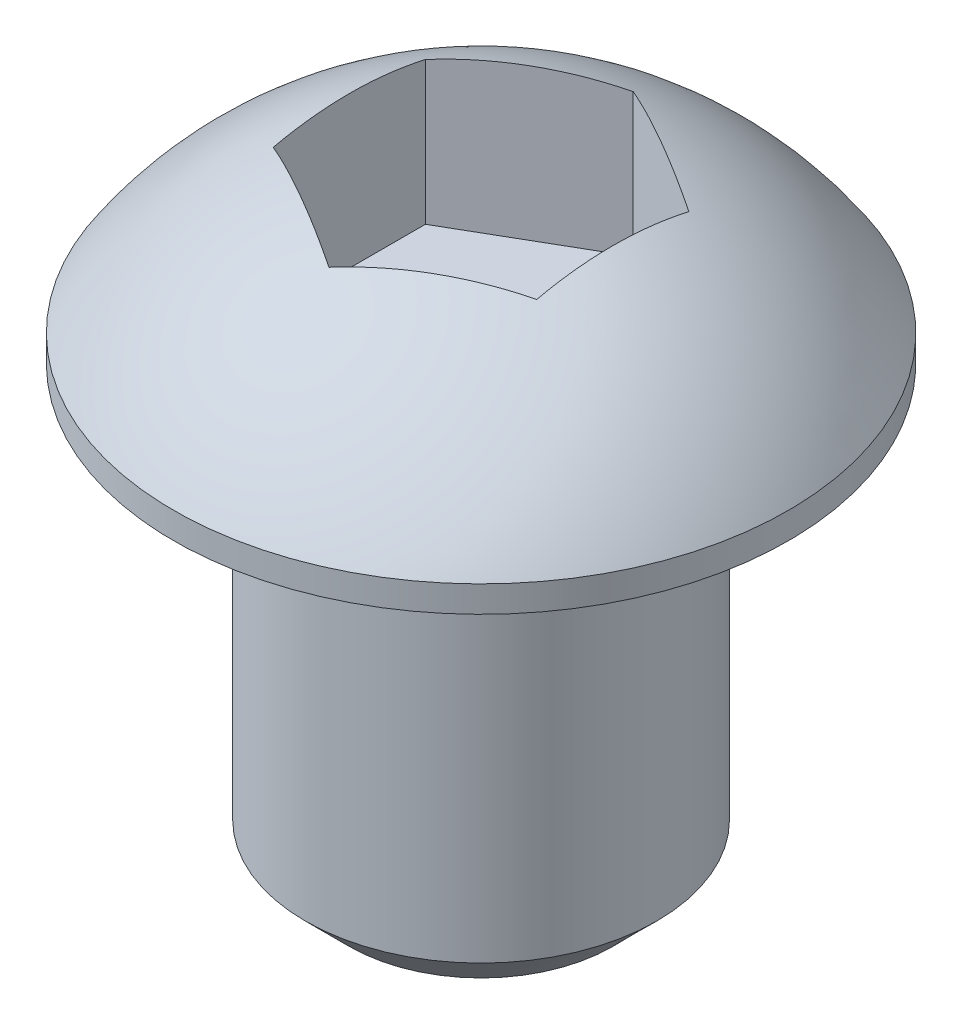
ISO-10303-21;
HEADER;
FILE_DESCRIPTION(('STEP AP214'),'2;1');
FILE_NAME('part.step','',(''),(''),'','','');
FILE_SCHEMA(('AUTOMOTIVE_DESIGN { 1 0 10303 214 1 1 1 1 }'));
ENDSEC;
DATA;
#1=APPLICATION_CONTEXT('core data for automotive mechanical design processes');
#2=APPLICATION_PROTOCOL_DEFINITION('international standard','automotive_design',2000,#1);
#3=PRODUCT_CONTEXT('',#1,'mechanical');
#4=PRODUCT('Part','Part','',(#3));
#5=PRODUCT_RELATED_PRODUCT_CATEGORY('part','',(#4));
#6=PRODUCT_DEFINITION_FORMATION('','',#4);
#7=PRODUCT_DEFINITION_CONTEXT('part definition',#1,'design');
#8=PRODUCT_DEFINITION('design','',#6,#7);
#9=PRODUCT_DEFINITION_SHAPE('','',#8);
#10=(LENGTH_UNIT() NAMED_UNIT(*) SI_UNIT(.MILLI.,.METRE.));
#11=(NAMED_UNIT(*) PLANE_ANGLE_UNIT() SI_UNIT($,.RADIAN.));
#12=(NAMED_UNIT(*) SI_UNIT($,.STERADIAN.) SOLID_ANGLE_UNIT());
#13=UNCERTAINTY_MEASURE_WITH_UNIT(LENGTH_MEASURE(1.E-05),#10,'distance_accuracy_value','');
#14=(GEOMETRIC_REPRESENTATION_CONTEXT(3) GLOBAL_UNCERTAINTY_ASSIGNED_CONTEXT((#13)) GLOBAL_UNIT_ASSIGNED_CONTEXT((#10,
#11,#12)) REPRESENTATION_CONTEXT('',''));
#15=CARTESIAN_POINT('',(0.,0.,0.));
#16=DIRECTION('',(0.,0.,1.));
#17=DIRECTION('',(1.,0.,0.));
#18=AXIS2_PLACEMENT_3D('',#15,#16,#17);
#19=CARTESIAN_POINT('',(0.,-5.,0.));
#20=DIRECTION('',(0.,1.,0.));
#21=DIRECTION('',(0.,0.,1.));
#22=AXIS2_PLACEMENT_3D('',#19,#20,#21);
#23=CYLINDRICAL_SURFACE('',#22,2.);
#24=CARTESIAN_POINT('',(0.,-4.5,0.));
#25=DIRECTION('',(0.,1.,0.));
#26=DIRECTION('',(0.,0.,1.));
#27=AXIS2_PLACEMENT_3D('',#24,#25,#26);
#28=CIRCLE('',#27,2.);
#29=CARTESIAN_POINT('',(0.,-4.5,2.));
#30=VERTEX_POINT('',#29);
#31=EDGE_CURVE('E139',#30,#30,#28,.T.);
#32=ORIENTED_EDGE('',*,*,#31,.T.);
#33=EDGE_LOOP('',(#32));
#34=FACE_BOUND('',#33,.T.);
#35=CARTESIAN_POINT('',(0.,0.,0.));
#36=DIRECTION('',(0.,1.,0.));
#37=DIRECTION('',(0.,0.,1.));
#38=AXIS2_PLACEMENT_3D('',#35,#36,#37);
#39=CIRCLE('',#38,2.);
#40=CARTESIAN_POINT('',(0.,0.,2.));
#41=VERTEX_POINT('',#40);
#42=EDGE_CURVE('E136',#41,#41,#39,.T.);
#43=ORIENTED_EDGE('',*,*,#42,.F.);
#44=EDGE_LOOP('',(#43));
#45=FACE_BOUND('',#44,.T.);
#46=ADVANCED_FACE('F38',(#34,#45),#23,.T.);
#47=CARTESIAN_POINT('',(0.,-5.,0.));
#48=DIRECTION('',(0.,1.,0.));
#49=DIRECTION('',(0.,0.,1.));
#50=AXIS2_PLACEMENT_3D('',#47,#48,#49);
#51=PLANE('',#50);
#52=CARTESIAN_POINT('',(0.,-5.,0.));
#53=DIRECTION('',(0.,1.,0.));
#54=DIRECTION('',(0.,0.,1.));
#55=AXIS2_PLACEMENT_3D('',#52,#53,#54);
#56=CIRCLE('',#55,1.5);
#57=CARTESIAN_POINT('',(0.,-5.,1.5));
#58=VERTEX_POINT('',#57);
#59=EDGE_CURVE('E142',#58,#58,#56,.F.);
#60=ORIENTED_EDGE('',*,*,#59,.T.);
#61=EDGE_LOOP('',(#60));
#62=FACE_BOUND('',#61,.T.);
#63=ADVANCED_FACE('F177',(#62),#51,.F.);
#64=CARTESIAN_POINT('',(-3.5,0.,0.));
#65=DIRECTION('',(0.,1.,0.));
#66=DIRECTION('',(0.,0.,1.));
#67=AXIS2_PLACEMENT_3D('',#64,#65,#66);
#68=PLANE('',#67);
#69=ORIENTED_EDGE('',*,*,#42,.T.);
#70=EDGE_LOOP('',(#69));
#71=FACE_BOUND('',#70,.T.);
#72=CARTESIAN_POINT('',(0.,0.,0.));
#73=DIRECTION('',(0.,-1.,0.));
#74=DIRECTION('',(0.,0.,-1.));
#75=AXIS2_PLACEMENT_3D('',#72,#73,#74);
#76=CIRCLE('',#75,3.5);
#77=CARTESIAN_POINT('',(0.,0.,-3.5));
#78=VERTEX_POINT('',#77);
#79=EDGE_CURVE('E133',#78,#78,#76,.T.);
#80=ORIENTED_EDGE('',*,*,#79,.T.);
#81=EDGE_LOOP('',(#80));
#82=FACE_BOUND('',#81,.T.);
#83=ADVANCED_FACE('F182',(#71,#82),#68,.F.);
#84=CARTESIAN_POINT('',(0.,-2.,0.));
#85=DIRECTION('',(0.,-1.,0.));
#86=DIRECTION('',(0.,0.,-1.));
#87=AXIS2_PLACEMENT_3D('',#84,#85,#86);
#88=CYLINDRICAL_SURFACE('',#87,3.5);
#89=ORIENTED_EDGE('',*,*,#79,.F.);
#90=EDGE_LOOP('',(#89));
#91=FACE_BOUND('',#90,.T.);
#92=CARTESIAN_POINT('',(0.,0.3,0.));
#93=DIRECTION('',(0.,-1.,0.));
#94=DIRECTION('',(0.,0.,-1.));
#95=AXIS2_PLACEMENT_3D('',#92,#93,#94);
#96=CIRCLE('',#95,3.5);
#97=CARTESIAN_POINT('',(0.,0.3,-3.5));
#98=VERTEX_POINT('',#97);
#99=EDGE_CURVE('E121',#98,#98,#96,.T.);
#100=ORIENTED_EDGE('',*,*,#99,.T.);
#101=EDGE_LOOP('',(#100));
#102=FACE_BOUND('',#101,.T.);
#103=ADVANCED_FACE('F189',(#91,#102),#88,.T.);
#104=CARTESIAN_POINT('',(0.,-2.,0.));
#105=DIRECTION('',(0.,-1.,0.));
#106=DIRECTION('',(-1.,0.,0.));
#107=AXIS2_PLACEMENT_3D('',#104,#105,#106);
#108=SPHERICAL_SURFACE('',#107,4.18807831827439);
#109=CARTESIAN_POINT('',(-0.75,-2.,-1.29903810567666));
#110=DIRECTION('',(-0.5,0.,-0.866025403784439));
#111=DIRECTION('',(-0.866025403784439,0.,0.5));
#112=AXIS2_PLACEMENT_3D('',#109,#110,#111);
#113=CIRCLE('',#112,3.91024295920343);
#114=CARTESIAN_POINT('',(-1.5,1.81313519298752,-0.866025403784439));
#115=VERTEX_POINT('',#114);
#116=CARTESIAN_POINT('',(0.,1.81313519298752,-1.73205080756888));
#117=VERTEX_POINT('',#116);
#118=EDGE_CURVE('E145',#115,#117,#113,.T.);
#119=ORIENTED_EDGE('',*,*,#118,.T.);
#120=CARTESIAN_POINT('',(0.749999999999999,-2.,-1.29903810567666));
#121=DIRECTION('',(0.5,0.,-0.866025403784439));
#122=DIRECTION('',(-0.866025403784439,0.,-0.5));
#123=AXIS2_PLACEMENT_3D('',#120,#121,#122);
#124=CIRCLE('',#123,3.91024295920343);
#125=CARTESIAN_POINT('',(1.5,1.81313519298752,-0.866025403784439));
#126=VERTEX_POINT('',#125);
#127=EDGE_CURVE('E11',#117,#126,#124,.T.);
#128=ORIENTED_EDGE('',*,*,#127,.T.);
#129=CARTESIAN_POINT('',(1.5,-2.,0.));
#130=DIRECTION('',(1.,0.,0.));
#131=DIRECTION('',(0.,0.,-1.));
#132=AXIS2_PLACEMENT_3D('',#129,#130,#131);
#133=CIRCLE('',#132,3.91024295920343);
#134=CARTESIAN_POINT('',(1.5,1.81313519298752,0.866025403784438));
#135=VERTEX_POINT('',#134);
#136=EDGE_CURVE('E46',#126,#135,#133,.T.);
#137=ORIENTED_EDGE('',*,*,#136,.T.);
#138=CARTESIAN_POINT('',(0.75,-2.,1.29903810567666));
#139=DIRECTION('',(0.5,0.,0.866025403784439));
#140=DIRECTION('',(0.866025403784439,0.,-0.5));
#141=AXIS2_PLACEMENT_3D('',#138,#139,#140);
#142=CIRCLE('',#141,3.91024295920343);
#143=CARTESIAN_POINT('',(0.,1.81313519298752,1.73205080756888));
#144=VERTEX_POINT('',#143);
#145=EDGE_CURVE('E153',#135,#144,#142,.T.);
#146=ORIENTED_EDGE('',*,*,#145,.T.);
#147=CARTESIAN_POINT('',(-0.75,-2.,1.29903810567666));
#148=DIRECTION('',(-0.5,0.,0.866025403784439));
#149=DIRECTION('',(0.866025403784439,0.,0.5));
#150=AXIS2_PLACEMENT_3D('',#147,#148,#149);
#151=CIRCLE('',#150,3.91024295920343);
#152=CARTESIAN_POINT('',(-1.5,1.81313519298752,0.866025403784439));
#153=VERTEX_POINT('',#152);
#154=EDGE_CURVE('E150',#144,#153,#151,.T.);
#155=ORIENTED_EDGE('',*,*,#154,.T.);
#156=CARTESIAN_POINT('',(-1.5,-2.,0.));
#157=DIRECTION('',(-1.,0.,0.));
#158=DIRECTION('',(0.,0.,1.));
#159=AXIS2_PLACEMENT_3D('',#156,#157,#158);
#160=CIRCLE('',#159,3.91024295920343);
#161=EDGE_CURVE('E147',#153,#115,#160,.T.);
#162=ORIENTED_EDGE('',*,*,#161,.T.);
#163=EDGE_LOOP('',(#119,#128,#137,#146,#155,#162));
#164=FACE_BOUND('',#163,.T.);
#165=ORIENTED_EDGE('',*,*,#99,.F.);
#166=EDGE_LOOP('',(#165));
#167=FACE_BOUND('',#166,.T.);
#168=ADVANCED_FACE('F156',(#164,#167),#108,.T.);
#169=CARTESIAN_POINT('',(0.,-4.5,0.));
#170=DIRECTION('',(0.,1.,0.));
#171=DIRECTION('',(0.,0.,1.));
#172=AXIS2_PLACEMENT_3D('',#169,#170,#171);
#173=CONICAL_SURFACE('',#172,2.,0.78539816339745);
#174=ORIENTED_EDGE('',*,*,#59,.F.);
#175=EDGE_LOOP('',(#174));
#176=FACE_BOUND('',#175,.T.);
#177=ORIENTED_EDGE('',*,*,#31,.F.);
#178=EDGE_LOOP('',(#177));
#179=FACE_BOUND('',#178,.T.);
#180=ADVANCED_FACE('F40',(#176,#179),#173,.T.);
#181=CARTESIAN_POINT('',(1.5,0.188078318274386,-0.866025403784439));
#182=DIRECTION('',(0.5,0.,-0.866025403784439));
#183=DIRECTION('',(-0.866025403784439,0.,-0.5));
#184=AXIS2_PLACEMENT_3D('',#181,#182,#183);
#185=PLANE('',#184);
#186=DIRECTION('',(0.,1.,0.));
#187=VECTOR('',#186,1.);
#188=CARTESIAN_POINT('',(0.,0.188078318274386,-1.73205080756888));
#189=LINE('',#188,#187);
#190=CARTESIAN_POINT('',(0.,0.188078318274386,-1.73205080756888));
#191=VERTEX_POINT('',#190);
#192=EDGE_CURVE('E53',#191,#117,#189,.T.);
#193=ORIENTED_EDGE('',*,*,#192,.F.);
#194=DIRECTION('',(-0.866025403784439,0.,-0.5));
#195=VECTOR('',#194,1.);
#196=CARTESIAN_POINT('',(1.5,0.188078318274386,-0.866025403784439));
#197=LINE('',#196,#195);
#198=CARTESIAN_POINT('',(1.5,0.188078318274386,-0.866025403784439));
#199=VERTEX_POINT('',#198);
#200=EDGE_CURVE('E92',#199,#191,#197,.T.);
#201=ORIENTED_EDGE('',*,*,#200,.F.);
#202=DIRECTION('',(0.,1.,0.));
#203=VECTOR('',#202,1.);
#204=CARTESIAN_POINT('',(1.5,0.188078318274386,-0.866025403784439));
#205=LINE('',#204,#203);
#206=EDGE_CURVE('E119',#199,#126,#205,.T.);
#207=ORIENTED_EDGE('',*,*,#206,.T.);
#208=ORIENTED_EDGE('',*,*,#127,.F.);
#209=EDGE_LOOP('',(#193,#201,#207,#208));
#210=FACE_BOUND('',#209,.T.);
#211=ADVANCED_FACE('F90',(#210),#185,.F.);
#212=CARTESIAN_POINT('',(1.5,0.188078318274386,0.866025403784438));
#213=DIRECTION('',(1.,0.,0.));
#214=DIRECTION('',(0.,0.,-1.));
#215=AXIS2_PLACEMENT_3D('',#212,#213,#214);
#216=PLANE('',#215);
#217=ORIENTED_EDGE('',*,*,#206,.F.);
#218=DIRECTION('',(0.,0.,-1.));
#219=VECTOR('',#218,1.);
#220=CARTESIAN_POINT('',(1.5,0.188078318274386,0.866025403784438));
#221=LINE('',#220,#219);
#222=CARTESIAN_POINT('',(1.5,0.188078318274386,0.866025403784438));
#223=VERTEX_POINT('',#222);
#224=EDGE_CURVE('E96',#223,#199,#221,.T.);
#225=ORIENTED_EDGE('',*,*,#224,.F.);
#226=DIRECTION('',(0.,1.,0.));
#227=VECTOR('',#226,1.);
#228=CARTESIAN_POINT('',(1.5,0.188078318274386,0.866025403784438));
#229=LINE('',#228,#227);
#230=EDGE_CURVE('E122',#223,#135,#229,.T.);
#231=ORIENTED_EDGE('',*,*,#230,.T.);
#232=ORIENTED_EDGE('',*,*,#136,.F.);
#233=EDGE_LOOP('',(#217,#225,#231,#232));
#234=FACE_BOUND('',#233,.T.);
#235=ADVANCED_FACE('F166',(#234),#216,.F.);
#236=CARTESIAN_POINT('',(0.,0.188078318274386,1.73205080756888));
#237=DIRECTION('',(0.5,0.,0.866025403784439));
#238=DIRECTION('',(0.866025403784439,0.,-0.5));
#239=AXIS2_PLACEMENT_3D('',#236,#237,#238);
#240=PLANE('',#239);
#241=ORIENTED_EDGE('',*,*,#230,.F.);
#242=DIRECTION('',(0.866025403784439,0.,-0.5));
#243=VECTOR('',#242,1.);
#244=CARTESIAN_POINT('',(0.,0.188078318274386,1.73205080756888));
#245=LINE('',#244,#243);
#246=CARTESIAN_POINT('',(0.,0.188078318274386,1.73205080756888));
#247=VERTEX_POINT('',#246);
#248=EDGE_CURVE('E116',#247,#223,#245,.T.);
#249=ORIENTED_EDGE('',*,*,#248,.F.);
#250=DIRECTION('',(0.,1.,0.));
#251=VECTOR('',#250,1.);
#252=CARTESIAN_POINT('',(0.,0.188078318274386,1.73205080756888));
#253=LINE('',#252,#251);
#254=EDGE_CURVE('E124',#247,#144,#253,.T.);
#255=ORIENTED_EDGE('',*,*,#254,.T.);
#256=ORIENTED_EDGE('',*,*,#145,.F.);
#257=EDGE_LOOP('',(#241,#249,#255,#256));
#258=FACE_BOUND('',#257,.T.);
#259=ADVANCED_FACE('F165',(#258),#240,.F.);
#260=CARTESIAN_POINT('',(-1.5,0.188078318274386,0.866025403784439));
#261=DIRECTION('',(-0.5,0.,0.866025403784439));
#262=DIRECTION('',(0.866025403784439,0.,0.5));
#263=AXIS2_PLACEMENT_3D('',#260,#261,#262);
#264=PLANE('',#263);
#265=ORIENTED_EDGE('',*,*,#254,.F.);
#266=DIRECTION('',(0.866025403784439,0.,0.5));
#267=VECTOR('',#266,1.);
#268=CARTESIAN_POINT('',(-1.5,0.188078318274386,0.866025403784439));
#269=LINE('',#268,#267);
#270=CARTESIAN_POINT('',(-1.5,0.188078318274386,0.866025403784439));
#271=VERTEX_POINT('',#270);
#272=EDGE_CURVE('E113',#271,#247,#269,.T.);
#273=ORIENTED_EDGE('',*,*,#272,.F.);
#274=DIRECTION('',(0.,1.,0.));
#275=VECTOR('',#274,1.);
#276=CARTESIAN_POINT('',(-1.5,0.188078318274386,0.866025403784439));
#277=LINE('',#276,#275);
#278=EDGE_CURVE('E127',#271,#153,#277,.T.);
#279=ORIENTED_EDGE('',*,*,#278,.T.);
#280=ORIENTED_EDGE('',*,*,#154,.F.);
#281=EDGE_LOOP('',(#265,#273,#279,#280));
#282=FACE_BOUND('',#281,.T.);
#283=ADVANCED_FACE('F163',(#282),#264,.F.);
#284=CARTESIAN_POINT('',(-1.5,0.188078318274386,-0.866025403784438));
#285=DIRECTION('',(-1.,0.,0.));
#286=DIRECTION('',(0.,0.,1.));
#287=AXIS2_PLACEMENT_3D('',#284,#285,#286);
#288=PLANE('',#287);
#289=ORIENTED_EDGE('',*,*,#278,.F.);
#290=DIRECTION('',(0.,0.,1.));
#291=VECTOR('',#290,1.);
#292=CARTESIAN_POINT('',(-1.5,0.188078318274386,-0.866025403784438));
#293=LINE('',#292,#291);
#294=CARTESIAN_POINT('',(-1.5,0.188078318274386,-0.866025403784438));
#295=VERTEX_POINT('',#294);
#296=EDGE_CURVE('E105',#295,#271,#293,.T.);
#297=ORIENTED_EDGE('',*,*,#296,.F.);
#298=DIRECTION('',(0.,1.,0.));
#299=VECTOR('',#298,1.);
#300=CARTESIAN_POINT('',(-1.5,0.188078318274386,-0.866025403784438));
#301=LINE('',#300,#299);
#302=EDGE_CURVE('E95',#295,#115,#301,.T.);
#303=ORIENTED_EDGE('',*,*,#302,.T.);
#304=ORIENTED_EDGE('',*,*,#161,.F.);
#305=EDGE_LOOP('',(#289,#297,#303,#304));
#306=FACE_BOUND('',#305,.T.);
#307=ADVANCED_FACE('F159',(#306),#288,.F.);
#308=CARTESIAN_POINT('',(0.,0.188078318274386,-1.73205080756888));
#309=DIRECTION('',(-0.5,0.,-0.866025403784439));
#310=DIRECTION('',(-0.866025403784439,0.,0.5));
#311=AXIS2_PLACEMENT_3D('',#308,#309,#310);
#312=PLANE('',#311);
#313=ORIENTED_EDGE('',*,*,#302,.F.);
#314=DIRECTION('',(-0.866025403784439,0.,0.5));
#315=VECTOR('',#314,1.);
#316=CARTESIAN_POINT('',(0.,0.188078318274386,-1.73205080756888));
#317=LINE('',#316,#315);
#318=EDGE_CURVE('E99',#191,#295,#317,.T.);
#319=ORIENTED_EDGE('',*,*,#318,.F.);
#320=ORIENTED_EDGE('',*,*,#192,.T.);
#321=ORIENTED_EDGE('',*,*,#118,.F.);
#322=EDGE_LOOP('',(#313,#319,#320,#321));
#323=FACE_BOUND('',#322,.T.);
#324=ADVANCED_FACE('F100',(#323),#312,.F.);
#325=CARTESIAN_POINT('',(0.,0.188078318274386,0.));
#326=DIRECTION('',(0.,1.,0.));
#327=DIRECTION('',(0.,0.,1.));
#328=AXIS2_PLACEMENT_3D('',#325,#326,#327);
#329=PLANE('',#328);
#330=ORIENTED_EDGE('',*,*,#200,.T.);
#331=ORIENTED_EDGE('',*,*,#318,.T.);
#332=ORIENTED_EDGE('',*,*,#296,.T.);
#333=ORIENTED_EDGE('',*,*,#272,.T.);
#334=ORIENTED_EDGE('',*,*,#248,.T.);
#335=ORIENTED_EDGE('',*,*,#224,.T.);
#336=EDGE_LOOP('',(#330,#331,#332,#333,#334,#335));
#337=FACE_BOUND('',#336,.T.);
#338=ADVANCED_FACE('F107',(#337),#329,.T.);
#339=CLOSED_SHELL('',(#46,#63,#83,#103,#168,#180,#211,#235,#259,#283,#307,#324,#338));
#340=MANIFOLD_SOLID_BREP('B2',#339);
#341=ADVANCED_BREP_SHAPE_REPRESENTATION('',(#18,#340),#14);
#342=SHAPE_DEFINITION_REPRESENTATION(#9,#341);
ENDSEC;
END-ISO-10303-21;
